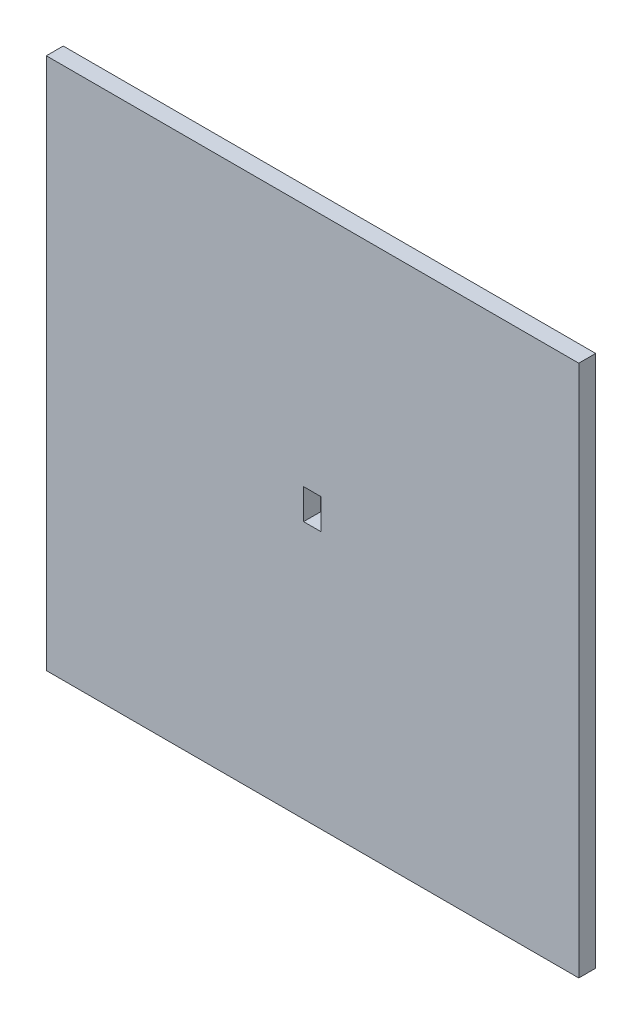
ISO-10303-21;
HEADER;
FILE_DESCRIPTION(('STEP AP214'),'2;1');
FILE_NAME('part.step','',(''),(''),'','','');
FILE_SCHEMA(('AUTOMOTIVE_DESIGN { 1 0 10303 214 1 1 1 1 }'));
ENDSEC;
DATA;
#1=APPLICATION_CONTEXT('core data for automotive mechanical design processes');
#2=APPLICATION_PROTOCOL_DEFINITION('international standard','automotive_design',2000,#1);
#3=PRODUCT_CONTEXT('',#1,'mechanical');
#4=PRODUCT('Part','Part','',(#3));
#5=PRODUCT_RELATED_PRODUCT_CATEGORY('part','',(#4));
#6=PRODUCT_DEFINITION_FORMATION('','',#4);
#7=PRODUCT_DEFINITION_CONTEXT('part definition',#1,'design');
#8=PRODUCT_DEFINITION('design','',#6,#7);
#9=PRODUCT_DEFINITION_SHAPE('','',#8);
#10=(LENGTH_UNIT() NAMED_UNIT(*) SI_UNIT(.MILLI.,.METRE.));
#11=(NAMED_UNIT(*) PLANE_ANGLE_UNIT() SI_UNIT($,.RADIAN.));
#12=(NAMED_UNIT(*) SI_UNIT($,.STERADIAN.) SOLID_ANGLE_UNIT());
#13=UNCERTAINTY_MEASURE_WITH_UNIT(LENGTH_MEASURE(1.E-05),#10,'distance_accuracy_value','');
#14=(GEOMETRIC_REPRESENTATION_CONTEXT(3) GLOBAL_UNCERTAINTY_ASSIGNED_CONTEXT((#13)) GLOBAL_UNIT_ASSIGNED_CONTEXT((#10,
#11,#12)) REPRESENTATION_CONTEXT('',''));
#15=CARTESIAN_POINT('',(0.,0.,0.));
#16=DIRECTION('',(0.,0.,1.));
#17=DIRECTION('',(1.,0.,0.));
#18=AXIS2_PLACEMENT_3D('',#15,#16,#17);
#19=CARTESIAN_POINT('',(0.,0.,3.175));
#20=DIRECTION('',(1.,0.,0.));
#21=DIRECTION('',(0.,0.,-1.));
#22=AXIS2_PLACEMENT_3D('',#19,#20,#21);
#23=PLANE('',#22);
#24=DIRECTION('',(0.,-1.,0.));
#25=VECTOR('',#24,1.);
#26=CARTESIAN_POINT('',(0.,0.,0.));
#27=LINE('',#26,#25);
#28=CARTESIAN_POINT('',(0.,100.,0.));
#29=VERTEX_POINT('',#28);
#30=CARTESIAN_POINT('',(0.,0.,0.));
#31=VERTEX_POINT('',#30);
#32=EDGE_CURVE('E134',#29,#31,#27,.T.);
#33=ORIENTED_EDGE('',*,*,#32,.T.);
#34=DIRECTION('',(0.,0.,-1.));
#35=VECTOR('',#34,1.);
#36=CARTESIAN_POINT('',(0.,0.,3.175));
#37=LINE('',#36,#35);
#38=CARTESIAN_POINT('',(0.,0.,3.175));
#39=VERTEX_POINT('',#38);
#40=EDGE_CURVE('E11',#39,#31,#37,.T.);
#41=ORIENTED_EDGE('',*,*,#40,.F.);
#42=DIRECTION('',(0.,-1.,0.));
#43=VECTOR('',#42,1.);
#44=CARTESIAN_POINT('',(0.,0.,3.175));
#45=LINE('',#44,#43);
#46=CARTESIAN_POINT('',(0.,100.,3.175));
#47=VERTEX_POINT('',#46);
#48=EDGE_CURVE('E138',#47,#39,#45,.T.);
#49=ORIENTED_EDGE('',*,*,#48,.F.);
#50=DIRECTION('',(0.,0.,-1.));
#51=VECTOR('',#50,1.);
#52=CARTESIAN_POINT('',(0.,100.,3.175));
#53=LINE('',#52,#51);
#54=EDGE_CURVE('E148',#47,#29,#53,.T.);
#55=ORIENTED_EDGE('',*,*,#54,.T.);
#56=EDGE_LOOP('',(#33,#41,#49,#55));
#57=FACE_BOUND('',#56,.T.);
#58=ADVANCED_FACE('F37',(#57),#23,.F.);
#59=CARTESIAN_POINT('',(0.,0.,3.175));
#60=DIRECTION('',(0.,1.,0.));
#61=DIRECTION('',(0.,0.,1.));
#62=AXIS2_PLACEMENT_3D('',#59,#60,#61);
#63=PLANE('',#62);
#64=DIRECTION('',(1.,0.,0.));
#65=VECTOR('',#64,1.);
#66=CARTESIAN_POINT('',(0.,0.,0.));
#67=LINE('',#66,#65);
#68=CARTESIAN_POINT('',(100.,0.,0.));
#69=VERTEX_POINT('',#68);
#70=EDGE_CURVE('E151',#31,#69,#67,.T.);
#71=ORIENTED_EDGE('',*,*,#70,.T.);
#72=DIRECTION('',(0.,0.,-1.));
#73=VECTOR('',#72,1.);
#74=CARTESIAN_POINT('',(100.,0.,3.175));
#75=LINE('',#74,#73);
#76=CARTESIAN_POINT('',(100.,0.,3.175));
#77=VERTEX_POINT('',#76);
#78=EDGE_CURVE('E44',#77,#69,#75,.T.);
#79=ORIENTED_EDGE('',*,*,#78,.F.);
#80=DIRECTION('',(1.,0.,0.));
#81=VECTOR('',#80,1.);
#82=CARTESIAN_POINT('',(0.,0.,3.175));
#83=LINE('',#82,#81);
#84=EDGE_CURVE('E141',#39,#77,#83,.T.);
#85=ORIENTED_EDGE('',*,*,#84,.F.);
#86=ORIENTED_EDGE('',*,*,#40,.T.);
#87=EDGE_LOOP('',(#71,#79,#85,#86));
#88=FACE_BOUND('',#87,.T.);
#89=ADVANCED_FACE('F179',(#88),#63,.F.);
#90=CARTESIAN_POINT('',(100.,0.,3.175));
#91=DIRECTION('',(-1.,0.,0.));
#92=DIRECTION('',(0.,0.,1.));
#93=AXIS2_PLACEMENT_3D('',#90,#91,#92);
#94=PLANE('',#93);
#95=DIRECTION('',(0.,1.,0.));
#96=VECTOR('',#95,1.);
#97=CARTESIAN_POINT('',(100.,0.,0.));
#98=LINE('',#97,#96);
#99=CARTESIAN_POINT('',(100.,100.,0.));
#100=VERTEX_POINT('',#99);
#101=EDGE_CURVE('E153',#69,#100,#98,.T.);
#102=ORIENTED_EDGE('',*,*,#101,.T.);
#103=DIRECTION('',(0.,0.,-1.));
#104=VECTOR('',#103,1.);
#105=CARTESIAN_POINT('',(100.,100.,3.175));
#106=LINE('',#105,#104);
#107=CARTESIAN_POINT('',(100.,100.,3.175));
#108=VERTEX_POINT('',#107);
#109=EDGE_CURVE('E158',#108,#100,#106,.T.);
#110=ORIENTED_EDGE('',*,*,#109,.F.);
#111=DIRECTION('',(0.,1.,0.));
#112=VECTOR('',#111,1.);
#113=CARTESIAN_POINT('',(100.,0.,3.175));
#114=LINE('',#113,#112);
#115=EDGE_CURVE('E144',#77,#108,#114,.T.);
#116=ORIENTED_EDGE('',*,*,#115,.F.);
#117=ORIENTED_EDGE('',*,*,#78,.T.);
#118=EDGE_LOOP('',(#102,#110,#116,#117));
#119=FACE_BOUND('',#118,.T.);
#120=ADVANCED_FACE('F165',(#119),#94,.F.);
#121=CARTESIAN_POINT('',(0.,100.,3.175));
#122=DIRECTION('',(0.,-1.,0.));
#123=DIRECTION('',(0.,0.,-1.));
#124=AXIS2_PLACEMENT_3D('',#121,#122,#123);
#125=PLANE('',#124);
#126=DIRECTION('',(-1.,0.,0.));
#127=VECTOR('',#126,1.);
#128=CARTESIAN_POINT('',(0.,100.,0.));
#129=LINE('',#128,#127);
#130=EDGE_CURVE('E142',#100,#29,#129,.T.);
#131=ORIENTED_EDGE('',*,*,#130,.T.);
#132=ORIENTED_EDGE('',*,*,#54,.F.);
#133=DIRECTION('',(-1.,0.,0.));
#134=VECTOR('',#133,1.);
#135=CARTESIAN_POINT('',(0.,100.,3.175));
#136=LINE('',#135,#134);
#137=EDGE_CURVE('E146',#108,#47,#136,.T.);
#138=ORIENTED_EDGE('',*,*,#137,.F.);
#139=ORIENTED_EDGE('',*,*,#109,.T.);
#140=EDGE_LOOP('',(#131,#132,#138,#139));
#141=FACE_BOUND('',#140,.T.);
#142=ADVANCED_FACE('F172',(#141),#125,.F.);
#143=CARTESIAN_POINT('',(0.,0.,3.175));
#144=DIRECTION('',(0.,0.,-1.));
#145=DIRECTION('',(-1.,0.,0.));
#146=AXIS2_PLACEMENT_3D('',#143,#144,#145);
#147=PLANE('',#146);
#148=DIRECTION('',(1.,0.,0.));
#149=VECTOR('',#148,1.);
#150=CARTESIAN_POINT('',(48.3164296886048,48.3835703113952,3.175));
#151=LINE('',#150,#149);
#152=CARTESIAN_POINT('',(48.3164296886048,48.3835703113952,3.175));
#153=VERTEX_POINT('',#152);
#154=CARTESIAN_POINT('',(51.6164296886048,48.3835703113952,3.175));
#155=VERTEX_POINT('',#154);
#156=EDGE_CURVE('E128',#153,#155,#151,.T.);
#157=ORIENTED_EDGE('',*,*,#156,.F.);
#158=DIRECTION('',(0.,-1.,0.));
#159=VECTOR('',#158,1.);
#160=CARTESIAN_POINT('',(48.3164296886048,54.0835703113952,3.175));
#161=LINE('',#160,#159);
#162=CARTESIAN_POINT('',(48.3164296886048,54.0835703113952,3.175));
#163=VERTEX_POINT('',#162);
#164=EDGE_CURVE('E51',#163,#153,#161,.T.);
#165=ORIENTED_EDGE('',*,*,#164,.F.);
#166=DIRECTION('',(-1.,0.,0.));
#167=VECTOR('',#166,1.);
#168=CARTESIAN_POINT('',(48.3164296886048,54.0835703113952,3.175));
#169=LINE('',#168,#167);
#170=CARTESIAN_POINT('',(51.6164296886048,54.0835703113952,3.175));
#171=VERTEX_POINT('',#170);
#172=EDGE_CURVE('E119',#171,#163,#169,.T.);
#173=ORIENTED_EDGE('',*,*,#172,.F.);
#174=DIRECTION('',(0.,1.,0.));
#175=VECTOR('',#174,1.);
#176=CARTESIAN_POINT('',(51.6164296886048,54.0835703113952,3.175));
#177=LINE('',#176,#175);
#178=EDGE_CURVE('E122',#155,#171,#177,.T.);
#179=ORIENTED_EDGE('',*,*,#178,.F.);
#180=EDGE_LOOP('',(#157,#165,#173,#179));
#181=FACE_BOUND('',#180,.T.);
#182=ORIENTED_EDGE('',*,*,#48,.T.);
#183=ORIENTED_EDGE('',*,*,#84,.T.);
#184=ORIENTED_EDGE('',*,*,#115,.T.);
#185=ORIENTED_EDGE('',*,*,#137,.T.);
#186=EDGE_LOOP('',(#182,#183,#184,#185));
#187=FACE_BOUND('',#186,.T.);
#188=ADVANCED_FACE('F178',(#181,#187),#147,.F.);
#189=CARTESIAN_POINT('',(0.,0.,0.));
#190=DIRECTION('',(0.,0.,-1.));
#191=DIRECTION('',(-1.,0.,0.));
#192=AXIS2_PLACEMENT_3D('',#189,#190,#191);
#193=PLANE('',#192);
#194=DIRECTION('',(0.,-1.,0.));
#195=VECTOR('',#194,1.);
#196=CARTESIAN_POINT('',(48.3164296886048,54.0835703113952,0.));
#197=LINE('',#196,#195);
#198=CARTESIAN_POINT('',(48.3164296886048,54.0835703113952,0.));
#199=VERTEX_POINT('',#198);
#200=CARTESIAN_POINT('',(48.3164296886048,48.3835703113952,0.));
#201=VERTEX_POINT('',#200);
#202=EDGE_CURVE('E103',#199,#201,#197,.T.);
#203=ORIENTED_EDGE('',*,*,#202,.T.);
#204=DIRECTION('',(1.,0.,0.));
#205=VECTOR('',#204,1.);
#206=CARTESIAN_POINT('',(48.3164296886048,48.3835703113952,0.));
#207=LINE('',#206,#205);
#208=CARTESIAN_POINT('',(51.6164296886048,48.3835703113952,0.));
#209=VERTEX_POINT('',#208);
#210=EDGE_CURVE('E112',#201,#209,#207,.T.);
#211=ORIENTED_EDGE('',*,*,#210,.T.);
#212=DIRECTION('',(0.,1.,0.));
#213=VECTOR('',#212,1.);
#214=CARTESIAN_POINT('',(51.6164296886048,54.0835703113952,0.));
#215=LINE('',#214,#213);
#216=CARTESIAN_POINT('',(51.6164296886048,54.0835703113952,0.));
#217=VERTEX_POINT('',#216);
#218=EDGE_CURVE('E59',#209,#217,#215,.T.);
#219=ORIENTED_EDGE('',*,*,#218,.T.);
#220=DIRECTION('',(-1.,0.,0.));
#221=VECTOR('',#220,1.);
#222=CARTESIAN_POINT('',(48.3164296886048,54.0835703113952,0.));
#223=LINE('',#222,#221);
#224=EDGE_CURVE('E109',#217,#199,#223,.T.);
#225=ORIENTED_EDGE('',*,*,#224,.T.);
#226=EDGE_LOOP('',(#203,#211,#219,#225));
#227=FACE_BOUND('',#226,.T.);
#228=ORIENTED_EDGE('',*,*,#32,.F.);
#229=ORIENTED_EDGE('',*,*,#130,.F.);
#230=ORIENTED_EDGE('',*,*,#101,.F.);
#231=ORIENTED_EDGE('',*,*,#70,.F.);
#232=EDGE_LOOP('',(#228,#229,#230,#231));
#233=FACE_BOUND('',#232,.T.);
#234=ADVANCED_FACE('F116',(#227,#233),#193,.T.);
#235=CARTESIAN_POINT('',(48.3164296886048,54.0835703113952,0.));
#236=DIRECTION('',(-1.,0.,0.));
#237=DIRECTION('',(0.,-1.,0.));
#238=AXIS2_PLACEMENT_3D('',#235,#236,#237);
#239=PLANE('',#238);
#240=ORIENTED_EDGE('',*,*,#164,.T.);
#241=DIRECTION('',(0.,0.,1.));
#242=VECTOR('',#241,1.);
#243=CARTESIAN_POINT('',(48.3164296886048,48.3835703113952,0.));
#244=LINE('',#243,#242);
#245=EDGE_CURVE('E99',#201,#153,#244,.T.);
#246=ORIENTED_EDGE('',*,*,#245,.F.);
#247=ORIENTED_EDGE('',*,*,#202,.F.);
#248=DIRECTION('',(0.,0.,1.));
#249=VECTOR('',#248,1.);
#250=CARTESIAN_POINT('',(48.3164296886048,54.0835703113952,0.));
#251=LINE('',#250,#249);
#252=EDGE_CURVE('E132',#199,#163,#251,.T.);
#253=ORIENTED_EDGE('',*,*,#252,.T.);
#254=EDGE_LOOP('',(#240,#246,#247,#253));
#255=FACE_BOUND('',#254,.T.);
#256=ADVANCED_FACE('F101',(#255),#239,.F.);
#257=CARTESIAN_POINT('',(48.3164296886048,54.0835703113952,0.));
#258=DIRECTION('',(0.,1.,0.));
#259=DIRECTION('',(0.,0.,1.));
#260=AXIS2_PLACEMENT_3D('',#257,#258,#259);
#261=PLANE('',#260);
#262=ORIENTED_EDGE('',*,*,#172,.T.);
#263=ORIENTED_EDGE('',*,*,#252,.F.);
#264=ORIENTED_EDGE('',*,*,#224,.F.);
#265=DIRECTION('',(0.,0.,1.));
#266=VECTOR('',#265,1.);
#267=CARTESIAN_POINT('',(51.6164296886048,54.0835703113952,0.));
#268=LINE('',#267,#266);
#269=EDGE_CURVE('E135',#217,#171,#268,.T.);
#270=ORIENTED_EDGE('',*,*,#269,.T.);
#271=EDGE_LOOP('',(#262,#263,#264,#270));
#272=FACE_BOUND('',#271,.T.);
#273=ADVANCED_FACE('F196',(#272),#261,.F.);
#274=CARTESIAN_POINT('',(51.6164296886048,54.0835703113952,0.));
#275=DIRECTION('',(1.,0.,0.));
#276=DIRECTION('',(0.,0.,-1.));
#277=AXIS2_PLACEMENT_3D('',#274,#275,#276);
#278=PLANE('',#277);
#279=ORIENTED_EDGE('',*,*,#178,.T.);
#280=ORIENTED_EDGE('',*,*,#269,.F.);
#281=ORIENTED_EDGE('',*,*,#218,.F.);
#282=DIRECTION('',(0.,0.,1.));
#283=VECTOR('',#282,1.);
#284=CARTESIAN_POINT('',(51.6164296886048,48.3835703113952,0.));
#285=LINE('',#284,#283);
#286=EDGE_CURVE('E108',#209,#155,#285,.T.);
#287=ORIENTED_EDGE('',*,*,#286,.T.);
#288=EDGE_LOOP('',(#279,#280,#281,#287));
#289=FACE_BOUND('',#288,.T.);
#290=ADVANCED_FACE('F199',(#289),#278,.F.);
#291=CARTESIAN_POINT('',(48.3164296886048,48.3835703113952,0.));
#292=DIRECTION('',(0.,-1.,0.));
#293=DIRECTION('',(0.,0.,-1.));
#294=AXIS2_PLACEMENT_3D('',#291,#292,#293);
#295=PLANE('',#294);
#296=ORIENTED_EDGE('',*,*,#156,.T.);
#297=ORIENTED_EDGE('',*,*,#286,.F.);
#298=ORIENTED_EDGE('',*,*,#210,.F.);
#299=ORIENTED_EDGE('',*,*,#245,.T.);
#300=EDGE_LOOP('',(#296,#297,#298,#299));
#301=FACE_BOUND('',#300,.T.);
#302=ADVANCED_FACE('F113',(#301),#295,.F.);
#303=CLOSED_SHELL('',(#58,#89,#120,#142,#188,#234,#256,#273,#290,#302));
#304=MANIFOLD_SOLID_BREP('B2',#303);
#305=ADVANCED_BREP_SHAPE_REPRESENTATION('',(#18,#304),#14);
#306=SHAPE_DEFINITION_REPRESENTATION(#9,#305);
ENDSEC;
END-ISO-10303-21;
